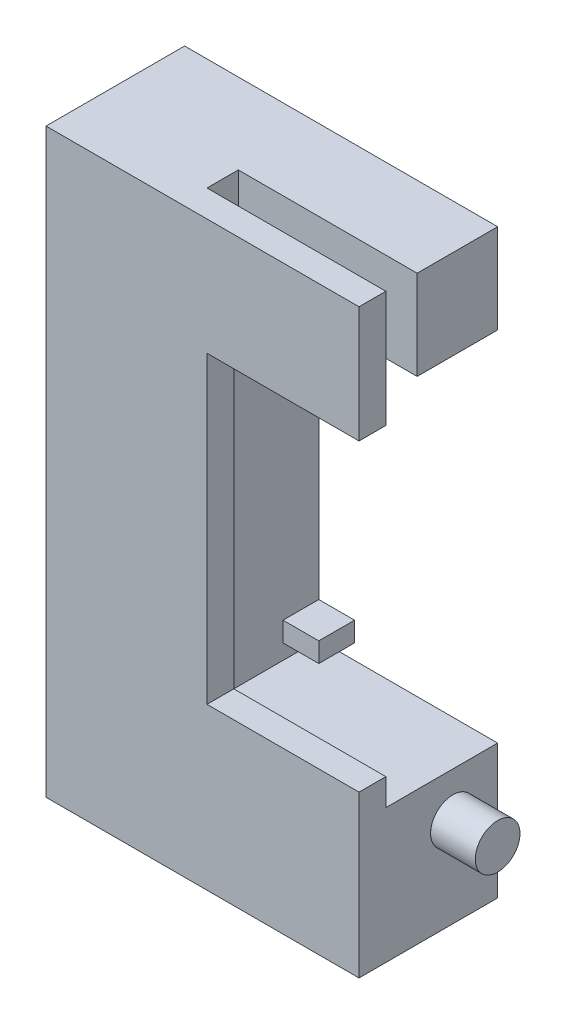
ISO-10303-21;
HEADER;
FILE_DESCRIPTION(('STEP AP214'),'2;1');
FILE_NAME('part.step','',(''),(''),'','','');
FILE_SCHEMA(('AUTOMOTIVE_DESIGN { 1 0 10303 214 1 1 1 1 }'));
ENDSEC;
DATA;
#1=APPLICATION_CONTEXT('core data for automotive mechanical design processes');
#2=APPLICATION_PROTOCOL_DEFINITION('international standard','automotive_design',2000,#1);
#3=PRODUCT_CONTEXT('',#1,'mechanical');
#4=PRODUCT('Part','Part','',(#3));
#5=PRODUCT_RELATED_PRODUCT_CATEGORY('part','',(#4));
#6=PRODUCT_DEFINITION_FORMATION('','',#4);
#7=PRODUCT_DEFINITION_CONTEXT('part definition',#1,'design');
#8=PRODUCT_DEFINITION('design','',#6,#7);
#9=PRODUCT_DEFINITION_SHAPE('','',#8);
#10=(LENGTH_UNIT() NAMED_UNIT(*) SI_UNIT(.MILLI.,.METRE.));
#11=(NAMED_UNIT(*) PLANE_ANGLE_UNIT() SI_UNIT($,.RADIAN.));
#12=(NAMED_UNIT(*) SI_UNIT($,.STERADIAN.) SOLID_ANGLE_UNIT());
#13=UNCERTAINTY_MEASURE_WITH_UNIT(LENGTH_MEASURE(1.E-05),#10,'distance_accuracy_value','');
#14=(GEOMETRIC_REPRESENTATION_CONTEXT(3) GLOBAL_UNCERTAINTY_ASSIGNED_CONTEXT((#13)) GLOBAL_UNIT_ASSIGNED_CONTEXT((#10,
#11,#12)) REPRESENTATION_CONTEXT('',''));
#15=CARTESIAN_POINT('',(0.,0.,0.));
#16=DIRECTION('',(0.,0.,1.));
#17=DIRECTION('',(1.,0.,0.));
#18=AXIS2_PLACEMENT_3D('',#15,#16,#17);
#19=CARTESIAN_POINT('',(15.,55.,-4.));
#20=DIRECTION('',(1.,0.,0.));
#21=DIRECTION('',(0.,1.,0.));
#22=AXIS2_PLACEMENT_3D('',#19,#20,#21);
#23=PLANE('',#22);
#24=DIRECTION('',(0.,-1.,0.));
#25=VECTOR('',#24,1.);
#26=CARTESIAN_POINT('',(15.,16.7,0.));
#27=LINE('',#26,#25);
#28=CARTESIAN_POINT('',(15.,18.9,0.));
#29=VERTEX_POINT('',#28);
#30=CARTESIAN_POINT('',(15.,16.7,0.));
#31=VERTEX_POINT('',#30);
#32=EDGE_CURVE('E57',#29,#31,#27,.T.);
#33=ORIENTED_EDGE('',*,*,#32,.F.);
#34=DIRECTION('',(0.,0.,1.));
#35=VECTOR('',#34,1.);
#36=CARTESIAN_POINT('',(15.,18.9,-4.));
#37=LINE('',#36,#35);
#38=CARTESIAN_POINT('',(15.,18.9,-4.));
#39=VERTEX_POINT('',#38);
#40=EDGE_CURVE('E697',#39,#29,#37,.T.);
#41=ORIENTED_EDGE('',*,*,#40,.F.);
#42=DIRECTION('',(0.,1.,0.));
#43=VECTOR('',#42,1.);
#44=CARTESIAN_POINT('',(15.,55.,-4.));
#45=LINE('',#44,#43);
#46=CARTESIAN_POINT('',(15.,51.1,-4.));
#47=VERTEX_POINT('',#46);
#48=EDGE_CURVE('E214',#39,#47,#45,.T.);
#49=ORIENTED_EDGE('',*,*,#48,.T.);
#50=DIRECTION('',(0.,0.,-1.));
#51=VECTOR('',#50,1.);
#52=CARTESIAN_POINT('',(15.,51.1,-4.));
#53=LINE('',#52,#51);
#54=CARTESIAN_POINT('',(15.,51.1,0.));
#55=VERTEX_POINT('',#54);
#56=EDGE_CURVE('E232',#55,#47,#53,.T.);
#57=ORIENTED_EDGE('',*,*,#56,.F.);
#58=DIRECTION('',(0.,-1.,0.));
#59=VECTOR('',#58,1.);
#60=CARTESIAN_POINT('',(15.,53.3,0.));
#61=LINE('',#60,#59);
#62=CARTESIAN_POINT('',(15.,53.3,0.));
#63=VERTEX_POINT('',#62);
#64=EDGE_CURVE('E221',#63,#55,#61,.T.);
#65=ORIENTED_EDGE('',*,*,#64,.F.);
#66=DIRECTION('',(0.,0.,1.));
#67=VECTOR('',#66,1.);
#68=CARTESIAN_POINT('',(15.,53.3,-4.));
#69=LINE('',#68,#67);
#70=CARTESIAN_POINT('',(15.,53.3,-4.));
#71=VERTEX_POINT('',#70);
#72=EDGE_CURVE('E216',#71,#63,#69,.T.);
#73=ORIENTED_EDGE('',*,*,#72,.F.);
#74=CARTESIAN_POINT('',(15.,55.,-4.));
#75=VERTEX_POINT('',#74);
#76=EDGE_CURVE('E374',#71,#75,#45,.T.);
#77=ORIENTED_EDGE('',*,*,#76,.T.);
#78=DIRECTION('',(0.,0.,1.));
#79=VECTOR('',#78,1.);
#80=CARTESIAN_POINT('',(15.,55.,-4.));
#81=LINE('',#80,#79);
#82=CARTESIAN_POINT('',(15.,55.,5.));
#83=VERTEX_POINT('',#82);
#84=EDGE_CURVE('E404',#75,#83,#81,.T.);
#85=ORIENTED_EDGE('',*,*,#84,.T.);
#86=DIRECTION('',(0.,1.,0.));
#87=VECTOR('',#86,1.);
#88=CARTESIAN_POINT('',(15.,55.,5.));
#89=LINE('',#88,#87);
#90=CARTESIAN_POINT('',(15.,65.,5.));
#91=VERTEX_POINT('',#90);
#92=EDGE_CURVE('E342',#83,#91,#89,.T.);
#93=ORIENTED_EDGE('',*,*,#92,.T.);
#94=DIRECTION('',(0.,0.,1.));
#95=VECTOR('',#94,1.);
#96=CARTESIAN_POINT('',(15.,65.,5.));
#97=LINE('',#96,#95);
#98=CARTESIAN_POINT('',(15.,65.,8.5));
#99=VERTEX_POINT('',#98);
#100=EDGE_CURVE('E337',#91,#99,#97,.T.);
#101=ORIENTED_EDGE('',*,*,#100,.T.);
#102=DIRECTION('',(0.,1.,0.));
#103=VECTOR('',#102,1.);
#104=CARTESIAN_POINT('',(15.,55.,8.5));
#105=LINE('',#104,#103);
#106=CARTESIAN_POINT('',(15.,15.,8.5));
#107=VERTEX_POINT('',#106);
#108=EDGE_CURVE('E358',#107,#99,#105,.T.);
#109=ORIENTED_EDGE('',*,*,#108,.F.);
#110=DIRECTION('',(0.,0.,1.));
#111=VECTOR('',#110,1.);
#112=CARTESIAN_POINT('',(15.,15.,-4.));
#113=LINE('',#112,#111);
#114=CARTESIAN_POINT('',(15.,15.,-4.));
#115=VERTEX_POINT('',#114);
#116=EDGE_CURVE('E408',#115,#107,#113,.T.);
#117=ORIENTED_EDGE('',*,*,#116,.F.);
#118=CARTESIAN_POINT('',(15.,16.7,-4.));
#119=VERTEX_POINT('',#118);
#120=EDGE_CURVE('E375',#115,#119,#45,.T.);
#121=ORIENTED_EDGE('',*,*,#120,.T.);
#122=DIRECTION('',(0.,0.,-1.));
#123=VECTOR('',#122,1.);
#124=CARTESIAN_POINT('',(15.,16.7,-4.));
#125=LINE('',#124,#123);
#126=EDGE_CURVE('E62',#31,#119,#125,.T.);
#127=ORIENTED_EDGE('',*,*,#126,.F.);
#128=EDGE_LOOP('',(#33,#41,#49,#57,#65,#73,#77,#85,#93,#101,#109,#117,#121,#127));
#129=FACE_BOUND('',#128,.T.);
#130=ADVANCED_FACE('F39',(#129),#23,.T.);
#131=CARTESIAN_POINT('',(35.,0.,-4.));
#132=DIRECTION('',(0.,-1.,0.));
#133=DIRECTION('',(1.,0.,0.));
#134=AXIS2_PLACEMENT_3D('',#131,#132,#133);
#135=PLANE('',#134);
#136=DIRECTION('',(0.,0.,1.));
#137=VECTOR('',#136,1.);
#138=CARTESIAN_POINT('',(35.,0.,-4.));
#139=LINE('',#138,#137);
#140=CARTESIAN_POINT('',(35.,0.,-4.));
#141=VERTEX_POINT('',#140);
#142=CARTESIAN_POINT('',(35.,0.,11.5));
#143=VERTEX_POINT('',#142);
#144=EDGE_CURVE('E43',#141,#143,#139,.T.);
#145=ORIENTED_EDGE('',*,*,#144,.T.);
#146=DIRECTION('',(1.,0.,0.));
#147=VECTOR('',#146,1.);
#148=CARTESIAN_POINT('',(35.,0.,11.5));
#149=LINE('',#148,#147);
#150=CARTESIAN_POINT('',(0.,0.,11.5));
#151=VERTEX_POINT('',#150);
#152=EDGE_CURVE('E296',#151,#143,#149,.T.);
#153=ORIENTED_EDGE('',*,*,#152,.F.);
#154=DIRECTION('',(0.,0.,1.));
#155=VECTOR('',#154,1.);
#156=CARTESIAN_POINT('',(0.,0.,-4.));
#157=LINE('',#156,#155);
#158=CARTESIAN_POINT('',(0.,0.,-4.));
#159=VERTEX_POINT('',#158);
#160=EDGE_CURVE('E11',#159,#151,#157,.T.);
#161=ORIENTED_EDGE('',*,*,#160,.F.);
#162=DIRECTION('',(1.,0.,0.));
#163=VECTOR('',#162,1.);
#164=CARTESIAN_POINT('',(35.,0.,-4.));
#165=LINE('',#164,#163);
#166=EDGE_CURVE('E362',#159,#141,#165,.T.);
#167=ORIENTED_EDGE('',*,*,#166,.T.);
#168=EDGE_LOOP('',(#145,#153,#161,#167));
#169=FACE_BOUND('',#168,.T.);
#170=ADVANCED_FACE('F41',(#169),#135,.T.);
#171=CARTESIAN_POINT('',(0.,0.,-4.));
#172=DIRECTION('',(-1.,0.,0.));
#173=DIRECTION('',(0.,0.,1.));
#174=AXIS2_PLACEMENT_3D('',#171,#172,#173);
#175=PLANE('',#174);
#176=ORIENTED_EDGE('',*,*,#160,.T.);
#177=DIRECTION('',(0.,-1.,0.));
#178=VECTOR('',#177,1.);
#179=CARTESIAN_POINT('',(0.,0.,11.5));
#180=LINE('',#179,#178);
#181=CARTESIAN_POINT('',(0.,65.,11.5));
#182=VERTEX_POINT('',#181);
#183=EDGE_CURVE('E292',#182,#151,#180,.T.);
#184=ORIENTED_EDGE('',*,*,#183,.F.);
#185=DIRECTION('',(0.,0.,1.));
#186=VECTOR('',#185,1.);
#187=CARTESIAN_POINT('',(0.,65.,-4.));
#188=LINE('',#187,#186);
#189=CARTESIAN_POINT('',(0.,65.,-4.));
#190=VERTEX_POINT('',#189);
#191=EDGE_CURVE('E49',#190,#182,#188,.T.);
#192=ORIENTED_EDGE('',*,*,#191,.F.);
#193=DIRECTION('',(0.,-1.,0.));
#194=VECTOR('',#193,1.);
#195=CARTESIAN_POINT('',(0.,0.,-4.));
#196=LINE('',#195,#194);
#197=EDGE_CURVE('E390',#190,#159,#196,.T.);
#198=ORIENTED_EDGE('',*,*,#197,.T.);
#199=EDGE_LOOP('',(#176,#184,#192,#198));
#200=FACE_BOUND('',#199,.T.);
#201=ADVANCED_FACE('F448',(#200),#175,.T.);
#202=CARTESIAN_POINT('',(0.,65.,-4.));
#203=DIRECTION('',(0.,1.,0.));
#204=DIRECTION('',(-1.,0.,0.));
#205=AXIS2_PLACEMENT_3D('',#202,#203,#204);
#206=PLANE('',#205);
#207=ORIENTED_EDGE('',*,*,#100,.F.);
#208=DIRECTION('',(-1.,0.,0.));
#209=VECTOR('',#208,1.);
#210=CARTESIAN_POINT('',(15.,65.,5.));
#211=LINE('',#210,#209);
#212=CARTESIAN_POINT('',(35.,65.,5.));
#213=VERTEX_POINT('',#212);
#214=EDGE_CURVE('E343',#213,#91,#211,.T.);
#215=ORIENTED_EDGE('',*,*,#214,.F.);
#216=DIRECTION('',(0.,0.,1.));
#217=VECTOR('',#216,1.);
#218=CARTESIAN_POINT('',(35.,65.,-4.));
#219=LINE('',#218,#217);
#220=CARTESIAN_POINT('',(35.,65.,-4.));
#221=VERTEX_POINT('',#220);
#222=EDGE_CURVE('E396',#221,#213,#219,.T.);
#223=ORIENTED_EDGE('',*,*,#222,.F.);
#224=DIRECTION('',(-1.,0.,0.));
#225=VECTOR('',#224,1.);
#226=CARTESIAN_POINT('',(0.,65.,-4.));
#227=LINE('',#226,#225);
#228=EDGE_CURVE('E386',#221,#190,#227,.T.);
#229=ORIENTED_EDGE('',*,*,#228,.T.);
#230=ORIENTED_EDGE('',*,*,#191,.T.);
#231=DIRECTION('',(-1.,0.,0.));
#232=VECTOR('',#231,1.);
#233=CARTESIAN_POINT('',(0.,65.,11.5));
#234=LINE('',#233,#232);
#235=CARTESIAN_POINT('',(35.,65.,11.5));
#236=VERTEX_POINT('',#235);
#237=EDGE_CURVE('E288',#236,#182,#234,.T.);
#238=ORIENTED_EDGE('',*,*,#237,.F.);
#239=DIRECTION('',(0.,0.,-1.));
#240=VECTOR('',#239,1.);
#241=CARTESIAN_POINT('',(35.,65.,11.5));
#242=LINE('',#241,#240);
#243=CARTESIAN_POINT('',(35.,65.,8.5));
#244=VERTEX_POINT('',#243);
#245=EDGE_CURVE('E300',#236,#244,#242,.T.);
#246=ORIENTED_EDGE('',*,*,#245,.T.);
#247=DIRECTION('',(-1.,0.,0.));
#248=VECTOR('',#247,1.);
#249=CARTESIAN_POINT('',(0.,65.,8.5));
#250=LINE('',#249,#248);
#251=EDGE_CURVE('E276',#244,#99,#250,.T.);
#252=ORIENTED_EDGE('',*,*,#251,.T.);
#253=EDGE_LOOP('',(#207,#215,#223,#229,#230,#238,#246,#252));
#254=FACE_BOUND('',#253,.T.);
#255=ADVANCED_FACE('F459',(#254),#206,.T.);
#256=CARTESIAN_POINT('',(35.,65.,-4.));
#257=DIRECTION('',(1.,0.,0.));
#258=DIRECTION('',(0.,1.,0.));
#259=AXIS2_PLACEMENT_3D('',#256,#257,#258);
#260=PLANE('',#259);
#261=DIRECTION('',(0.,1.,0.));
#262=VECTOR('',#261,1.);
#263=CARTESIAN_POINT('',(35.,65.,5.));
#264=LINE('',#263,#262);
#265=CARTESIAN_POINT('',(35.,55.,5.));
#266=VERTEX_POINT('',#265);
#267=EDGE_CURVE('E351',#266,#213,#264,.T.);
#268=ORIENTED_EDGE('',*,*,#267,.F.);
#269=DIRECTION('',(0.,0.,1.));
#270=VECTOR('',#269,1.);
#271=CARTESIAN_POINT('',(35.,55.,-4.));
#272=LINE('',#271,#270);
#273=CARTESIAN_POINT('',(35.,55.,-4.));
#274=VERTEX_POINT('',#273);
#275=EDGE_CURVE('E400',#274,#266,#272,.T.);
#276=ORIENTED_EDGE('',*,*,#275,.F.);
#277=DIRECTION('',(0.,1.,0.));
#278=VECTOR('',#277,1.);
#279=CARTESIAN_POINT('',(35.,65.,-4.));
#280=LINE('',#279,#278);
#281=EDGE_CURVE('E382',#274,#221,#280,.T.);
#282=ORIENTED_EDGE('',*,*,#281,.T.);
#283=ORIENTED_EDGE('',*,*,#222,.T.);
#284=EDGE_LOOP('',(#268,#276,#282,#283));
#285=FACE_BOUND('',#284,.T.);
#286=ADVANCED_FACE('F470',(#285),#260,.T.);
#287=CARTESIAN_POINT('',(35.,55.,-4.));
#288=DIRECTION('',(0.,-1.,0.));
#289=DIRECTION('',(1.,0.,0.));
#290=AXIS2_PLACEMENT_3D('',#287,#288,#289);
#291=PLANE('',#290);
#292=DIRECTION('',(-1.,0.,0.));
#293=VECTOR('',#292,1.);
#294=CARTESIAN_POINT('',(15.,55.,5.));
#295=LINE('',#294,#293);
#296=EDGE_CURVE('E338',#266,#83,#295,.T.);
#297=ORIENTED_EDGE('',*,*,#296,.T.);
#298=ORIENTED_EDGE('',*,*,#84,.F.);
#299=DIRECTION('',(1.,0.,0.));
#300=VECTOR('',#299,1.);
#301=CARTESIAN_POINT('',(35.,55.,-4.));
#302=LINE('',#301,#300);
#303=EDGE_CURVE('E378',#75,#274,#302,.T.);
#304=ORIENTED_EDGE('',*,*,#303,.T.);
#305=ORIENTED_EDGE('',*,*,#275,.T.);
#306=EDGE_LOOP('',(#297,#298,#304,#305));
#307=FACE_BOUND('',#306,.T.);
#308=ADVANCED_FACE('F466',(#307),#291,.T.);
#309=CARTESIAN_POINT('',(15.,15.,-4.));
#310=DIRECTION('',(0.,1.,0.));
#311=DIRECTION('',(0.,0.,1.));
#312=AXIS2_PLACEMENT_3D('',#309,#310,#311);
#313=PLANE('',#312);
#314=ORIENTED_EDGE('',*,*,#116,.T.);
#315=DIRECTION('',(-1.,0.,0.));
#316=VECTOR('',#315,1.);
#317=CARTESIAN_POINT('',(15.,15.,8.5));
#318=LINE('',#317,#316);
#319=CARTESIAN_POINT('',(35.,15.,8.5));
#320=VERTEX_POINT('',#319);
#321=EDGE_CURVE('E354',#320,#107,#318,.T.);
#322=ORIENTED_EDGE('',*,*,#321,.F.);
#323=DIRECTION('',(0.,0.,1.));
#324=VECTOR('',#323,1.);
#325=CARTESIAN_POINT('',(35.,15.,-4.));
#326=LINE('',#325,#324);
#327=CARTESIAN_POINT('',(35.,15.,-4.));
#328=VERTEX_POINT('',#327);
#329=EDGE_CURVE('E411',#328,#320,#326,.T.);
#330=ORIENTED_EDGE('',*,*,#329,.F.);
#331=DIRECTION('',(-1.,0.,0.));
#332=VECTOR('',#331,1.);
#333=CARTESIAN_POINT('',(15.,15.,-4.));
#334=LINE('',#333,#332);
#335=EDGE_CURVE('E370',#328,#115,#334,.T.);
#336=ORIENTED_EDGE('',*,*,#335,.T.);
#337=EDGE_LOOP('',(#314,#322,#330,#336));
#338=FACE_BOUND('',#337,.T.);
#339=ADVANCED_FACE('F454',(#338),#313,.T.);
#340=CARTESIAN_POINT('',(35.,15.,-4.));
#341=DIRECTION('',(1.,0.,0.));
#342=DIRECTION('',(0.,0.,-1.));
#343=AXIS2_PLACEMENT_3D('',#340,#341,#342);
#344=PLANE('',#343);
#345=CARTESIAN_POINT('',(35.,10.,1.));
#346=DIRECTION('',(1.,0.,0.));
#347=DIRECTION('',(0.,0.,-1.));
#348=AXIS2_PLACEMENT_3D('',#345,#346,#347);
#349=CIRCLE('',#348,2.5);
#350=CARTESIAN_POINT('',(35.,10.,-1.5));
#351=VERTEX_POINT('',#350);
#352=EDGE_CURVE('E262',#351,#351,#349,.T.);
#353=ORIENTED_EDGE('',*,*,#352,.F.);
#354=EDGE_LOOP('',(#353));
#355=FACE_BOUND('',#354,.T.);
#356=ORIENTED_EDGE('',*,*,#329,.T.);
#357=DIRECTION('',(0.,1.,0.));
#358=VECTOR('',#357,1.);
#359=CARTESIAN_POINT('',(35.,18.,8.5));
#360=LINE('',#359,#358);
#361=CARTESIAN_POINT('',(35.,18.,8.5));
#362=VERTEX_POINT('',#361);
#363=EDGE_CURVE('E267',#320,#362,#360,.T.);
#364=ORIENTED_EDGE('',*,*,#363,.T.);
#365=DIRECTION('',(0.,0.,-1.));
#366=VECTOR('',#365,1.);
#367=CARTESIAN_POINT('',(35.,18.,11.5));
#368=LINE('',#367,#366);
#369=CARTESIAN_POINT('',(35.,18.,11.5));
#370=VERTEX_POINT('',#369);
#371=EDGE_CURVE('E333',#370,#362,#368,.T.);
#372=ORIENTED_EDGE('',*,*,#371,.F.);
#373=DIRECTION('',(0.,1.,0.));
#374=VECTOR('',#373,1.);
#375=CARTESIAN_POINT('',(35.,18.,11.5));
#376=LINE('',#375,#374);
#377=EDGE_CURVE('E271',#143,#370,#376,.T.);
#378=ORIENTED_EDGE('',*,*,#377,.F.);
#379=ORIENTED_EDGE('',*,*,#144,.F.);
#380=DIRECTION('',(0.,1.,0.));
#381=VECTOR('',#380,1.);
#382=CARTESIAN_POINT('',(35.,15.,-4.));
#383=LINE('',#382,#381);
#384=EDGE_CURVE('E366',#141,#328,#383,.T.);
#385=ORIENTED_EDGE('',*,*,#384,.T.);
#386=EDGE_LOOP('',(#356,#364,#372,#378,#379,#385));
#387=FACE_BOUND('',#386,.T.);
#388=ADVANCED_FACE('F424',(#355,#387),#344,.T.);
#389=CARTESIAN_POINT('',(0.,0.,-4.));
#390=DIRECTION('',(0.,0.,-1.));
#391=DIRECTION('',(-1.,0.,0.));
#392=AXIS2_PLACEMENT_3D('',#389,#390,#391);
#393=PLANE('',#392);
#394=ORIENTED_EDGE('',*,*,#166,.F.);
#395=ORIENTED_EDGE('',*,*,#197,.F.);
#396=ORIENTED_EDGE('',*,*,#228,.F.);
#397=ORIENTED_EDGE('',*,*,#281,.F.);
#398=ORIENTED_EDGE('',*,*,#303,.F.);
#399=ORIENTED_EDGE('',*,*,#76,.F.);
#400=DIRECTION('',(-1.,0.,0.));
#401=VECTOR('',#400,1.);
#402=CARTESIAN_POINT('',(19.,53.3,-4.));
#403=LINE('',#402,#401);
#404=CARTESIAN_POINT('',(19.,53.3,-4.));
#405=VERTEX_POINT('',#404);
#406=EDGE_CURVE('E258',#405,#71,#403,.T.);
#407=ORIENTED_EDGE('',*,*,#406,.F.);
#408=DIRECTION('',(0.,1.,0.));
#409=VECTOR('',#408,1.);
#410=CARTESIAN_POINT('',(19.,53.3,-4.));
#411=LINE('',#410,#409);
#412=CARTESIAN_POINT('',(19.,51.1,-4.));
#413=VERTEX_POINT('',#412);
#414=EDGE_CURVE('E227',#413,#405,#411,.T.);
#415=ORIENTED_EDGE('',*,*,#414,.F.);
#416=DIRECTION('',(-1.,0.,0.));
#417=VECTOR('',#416,1.);
#418=CARTESIAN_POINT('',(19.,51.1,-4.));
#419=LINE('',#418,#417);
#420=EDGE_CURVE('E240',#413,#47,#419,.T.);
#421=ORIENTED_EDGE('',*,*,#420,.T.);
#422=ORIENTED_EDGE('',*,*,#48,.F.);
#423=DIRECTION('',(-1.,0.,0.));
#424=VECTOR('',#423,1.);
#425=CARTESIAN_POINT('',(19.,18.9,-4.));
#426=LINE('',#425,#424);
#427=CARTESIAN_POINT('',(19.,18.9,-4.));
#428=VERTEX_POINT('',#427);
#429=EDGE_CURVE('E193',#428,#39,#426,.T.);
#430=ORIENTED_EDGE('',*,*,#429,.F.);
#431=DIRECTION('',(0.,1.,0.));
#432=VECTOR('',#431,1.);
#433=CARTESIAN_POINT('',(19.,16.7,-4.));
#434=LINE('',#433,#432);
#435=CARTESIAN_POINT('',(19.,16.7,-4.));
#436=VERTEX_POINT('',#435);
#437=EDGE_CURVE('E200',#436,#428,#434,.T.);
#438=ORIENTED_EDGE('',*,*,#437,.F.);
#439=DIRECTION('',(-1.,0.,0.));
#440=VECTOR('',#439,1.);
#441=CARTESIAN_POINT('',(19.,16.7,-4.));
#442=LINE('',#441,#440);
#443=EDGE_CURVE('E685',#436,#119,#442,.T.);
#444=ORIENTED_EDGE('',*,*,#443,.T.);
#445=ORIENTED_EDGE('',*,*,#120,.F.);
#446=ORIENTED_EDGE('',*,*,#335,.F.);
#447=ORIENTED_EDGE('',*,*,#384,.F.);
#448=EDGE_LOOP('',(#394,#395,#396,#397,#398,#399,#407,#415,#421,#422,#430,#438,#444,#445,#446,#447));
#449=FACE_BOUND('',#448,.T.);
#450=ADVANCED_FACE('F212',(#449),#393,.T.);
#451=CARTESIAN_POINT('',(15.,55.,5.));
#452=DIRECTION('',(0.,0.,-1.));
#453=DIRECTION('',(-1.,0.,0.));
#454=AXIS2_PLACEMENT_3D('',#451,#452,#453);
#455=PLANE('',#454);
#456=ORIENTED_EDGE('',*,*,#267,.T.);
#457=ORIENTED_EDGE('',*,*,#214,.T.);
#458=ORIENTED_EDGE('',*,*,#92,.F.);
#459=ORIENTED_EDGE('',*,*,#296,.F.);
#460=EDGE_LOOP('',(#456,#457,#458,#459));
#461=FACE_BOUND('',#460,.T.);
#462=ADVANCED_FACE('F463',(#461),#455,.F.);
#463=CARTESIAN_POINT('',(18.,18.,11.5));
#464=DIRECTION('',(0.,-1.,0.));
#465=DIRECTION('',(0.,0.,-1.));
#466=AXIS2_PLACEMENT_3D('',#463,#464,#465);
#467=PLANE('',#466);
#468=DIRECTION('',(-1.,0.,0.));
#469=VECTOR('',#468,1.);
#470=CARTESIAN_POINT('',(18.,18.,8.5));
#471=LINE('',#470,#469);
#472=CARTESIAN_POINT('',(18.,18.,8.5));
#473=VERTEX_POINT('',#472);
#474=EDGE_CURVE('E303',#362,#473,#471,.T.);
#475=ORIENTED_EDGE('',*,*,#474,.T.);
#476=DIRECTION('',(0.,0.,-1.));
#477=VECTOR('',#476,1.);
#478=CARTESIAN_POINT('',(18.,18.,11.5));
#479=LINE('',#478,#477);
#480=CARTESIAN_POINT('',(18.,18.,11.5));
#481=VERTEX_POINT('',#480);
#482=EDGE_CURVE('E329',#481,#473,#479,.T.);
#483=ORIENTED_EDGE('',*,*,#482,.F.);
#484=DIRECTION('',(-1.,0.,0.));
#485=VECTOR('',#484,1.);
#486=CARTESIAN_POINT('',(18.,18.,11.5));
#487=LINE('',#486,#485);
#488=EDGE_CURVE('E275',#370,#481,#487,.T.);
#489=ORIENTED_EDGE('',*,*,#488,.F.);
#490=ORIENTED_EDGE('',*,*,#371,.T.);
#491=EDGE_LOOP('',(#475,#483,#489,#490));
#492=FACE_BOUND('',#491,.T.);
#493=ADVANCED_FACE('F428',(#492),#467,.F.);
#494=CARTESIAN_POINT('',(18.,52.,11.5));
#495=DIRECTION('',(-1.,0.,0.));
#496=DIRECTION('',(0.,-1.,0.));
#497=AXIS2_PLACEMENT_3D('',#494,#495,#496);
#498=PLANE('',#497);
#499=DIRECTION('',(0.,1.,0.));
#500=VECTOR('',#499,1.);
#501=CARTESIAN_POINT('',(18.,52.,8.5));
#502=LINE('',#501,#500);
#503=CARTESIAN_POINT('',(18.,52.,8.5));
#504=VERTEX_POINT('',#503);
#505=EDGE_CURVE('E306',#473,#504,#502,.T.);
#506=ORIENTED_EDGE('',*,*,#505,.T.);
#507=DIRECTION('',(0.,0.,-1.));
#508=VECTOR('',#507,1.);
#509=CARTESIAN_POINT('',(18.,52.,11.5));
#510=LINE('',#509,#508);
#511=CARTESIAN_POINT('',(18.,52.,11.5));
#512=VERTEX_POINT('',#511);
#513=EDGE_CURVE('E325',#512,#504,#510,.T.);
#514=ORIENTED_EDGE('',*,*,#513,.F.);
#515=DIRECTION('',(0.,1.,0.));
#516=VECTOR('',#515,1.);
#517=CARTESIAN_POINT('',(18.,52.,11.5));
#518=LINE('',#517,#516);
#519=EDGE_CURVE('E279',#481,#512,#518,.T.);
#520=ORIENTED_EDGE('',*,*,#519,.F.);
#521=ORIENTED_EDGE('',*,*,#482,.T.);
#522=EDGE_LOOP('',(#506,#514,#520,#521));
#523=FACE_BOUND('',#522,.T.);
#524=ADVANCED_FACE('F435',(#523),#498,.F.);
#525=CARTESIAN_POINT('',(35.,52.,11.5));
#526=DIRECTION('',(0.,1.,0.));
#527=DIRECTION('',(-1.,0.,0.));
#528=AXIS2_PLACEMENT_3D('',#525,#526,#527);
#529=PLANE('',#528);
#530=DIRECTION('',(1.,0.,0.));
#531=VECTOR('',#530,1.);
#532=CARTESIAN_POINT('',(35.,52.,8.5));
#533=LINE('',#532,#531);
#534=CARTESIAN_POINT('',(35.,52.,8.5));
#535=VERTEX_POINT('',#534);
#536=EDGE_CURVE('E309',#504,#535,#533,.T.);
#537=ORIENTED_EDGE('',*,*,#536,.T.);
#538=DIRECTION('',(0.,0.,-1.));
#539=VECTOR('',#538,1.);
#540=CARTESIAN_POINT('',(35.,52.,11.5));
#541=LINE('',#540,#539);
#542=CARTESIAN_POINT('',(35.,52.,11.5));
#543=VERTEX_POINT('',#542);
#544=EDGE_CURVE('E321',#543,#535,#541,.T.);
#545=ORIENTED_EDGE('',*,*,#544,.F.);
#546=DIRECTION('',(1.,0.,0.));
#547=VECTOR('',#546,1.);
#548=CARTESIAN_POINT('',(35.,52.,11.5));
#549=LINE('',#548,#547);
#550=EDGE_CURVE('E282',#512,#543,#549,.T.);
#551=ORIENTED_EDGE('',*,*,#550,.F.);
#552=ORIENTED_EDGE('',*,*,#513,.T.);
#553=EDGE_LOOP('',(#537,#545,#551,#552));
#554=FACE_BOUND('',#553,.T.);
#555=ADVANCED_FACE('F439',(#554),#529,.F.);
#556=CARTESIAN_POINT('',(35.,65.,11.5));
#557=DIRECTION('',(-1.,0.,0.));
#558=DIRECTION('',(0.,0.,1.));
#559=AXIS2_PLACEMENT_3D('',#556,#557,#558);
#560=PLANE('',#559);
#561=DIRECTION('',(0.,1.,0.));
#562=VECTOR('',#561,1.);
#563=CARTESIAN_POINT('',(35.,65.,8.5));
#564=LINE('',#563,#562);
#565=EDGE_CURVE('E312',#535,#244,#564,.T.);
#566=ORIENTED_EDGE('',*,*,#565,.T.);
#567=ORIENTED_EDGE('',*,*,#245,.F.);
#568=DIRECTION('',(0.,1.,0.));
#569=VECTOR('',#568,1.);
#570=CARTESIAN_POINT('',(35.,65.,11.5));
#571=LINE('',#570,#569);
#572=EDGE_CURVE('E285',#543,#236,#571,.T.);
#573=ORIENTED_EDGE('',*,*,#572,.F.);
#574=ORIENTED_EDGE('',*,*,#544,.T.);
#575=EDGE_LOOP('',(#566,#567,#573,#574));
#576=FACE_BOUND('',#575,.T.);
#577=ADVANCED_FACE('F444',(#576),#560,.F.);
#578=CARTESIAN_POINT('',(0.,0.,11.5));
#579=DIRECTION('',(0.,0.,-1.));
#580=DIRECTION('',(-1.,0.,0.));
#581=AXIS2_PLACEMENT_3D('',#578,#579,#580);
#582=PLANE('',#581);
#583=ORIENTED_EDGE('',*,*,#377,.T.);
#584=ORIENTED_EDGE('',*,*,#488,.T.);
#585=ORIENTED_EDGE('',*,*,#519,.T.);
#586=ORIENTED_EDGE('',*,*,#550,.T.);
#587=ORIENTED_EDGE('',*,*,#572,.T.);
#588=ORIENTED_EDGE('',*,*,#237,.T.);
#589=ORIENTED_EDGE('',*,*,#183,.T.);
#590=ORIENTED_EDGE('',*,*,#152,.T.);
#591=EDGE_LOOP('',(#583,#584,#585,#586,#587,#588,#589,#590));
#592=FACE_BOUND('',#591,.T.);
#593=ADVANCED_FACE('F421',(#592),#582,.F.);
#594=CARTESIAN_POINT('',(0.,0.,8.5));
#595=DIRECTION('',(0.,0.,-1.));
#596=DIRECTION('',(-1.,0.,0.));
#597=AXIS2_PLACEMENT_3D('',#594,#595,#596);
#598=PLANE('',#597);
#599=ORIENTED_EDGE('',*,*,#321,.T.);
#600=ORIENTED_EDGE('',*,*,#108,.T.);
#601=ORIENTED_EDGE('',*,*,#251,.F.);
#602=ORIENTED_EDGE('',*,*,#565,.F.);
#603=ORIENTED_EDGE('',*,*,#536,.F.);
#604=ORIENTED_EDGE('',*,*,#505,.F.);
#605=ORIENTED_EDGE('',*,*,#474,.F.);
#606=ORIENTED_EDGE('',*,*,#363,.F.);
#607=EDGE_LOOP('',(#599,#600,#601,#602,#603,#604,#605,#606));
#608=FACE_BOUND('',#607,.T.);
#609=ADVANCED_FACE('F456',(#608),#598,.T.);
#610=CARTESIAN_POINT('',(40.,10.,1.));
#611=DIRECTION('',(-1.,0.,0.));
#612=DIRECTION('',(0.,0.,1.));
#613=AXIS2_PLACEMENT_3D('',#610,#611,#612);
#614=CYLINDRICAL_SURFACE('',#613,2.5);
#615=CARTESIAN_POINT('',(40.,10.,1.));
#616=DIRECTION('',(1.,0.,0.));
#617=DIRECTION('',(0.,0.,-1.));
#618=AXIS2_PLACEMENT_3D('',#615,#616,#617);
#619=CIRCLE('',#618,2.5);
#620=CARTESIAN_POINT('',(40.,10.,-1.5));
#621=VERTEX_POINT('',#620);
#622=EDGE_CURVE('E263',#621,#621,#619,.T.);
#623=ORIENTED_EDGE('',*,*,#622,.F.);
#624=EDGE_LOOP('',(#623));
#625=FACE_BOUND('',#624,.T.);
#626=ORIENTED_EDGE('',*,*,#352,.T.);
#627=EDGE_LOOP('',(#626));
#628=FACE_BOUND('',#627,.T.);
#629=ADVANCED_FACE('F514',(#625,#628),#614,.T.);
#630=CARTESIAN_POINT('',(40.,10.,1.));
#631=DIRECTION('',(1.,0.,0.));
#632=DIRECTION('',(0.,0.,-1.));
#633=AXIS2_PLACEMENT_3D('',#630,#631,#632);
#634=PLANE('',#633);
#635=ORIENTED_EDGE('',*,*,#622,.T.);
#636=EDGE_LOOP('',(#635));
#637=FACE_BOUND('',#636,.T.);
#638=ADVANCED_FACE('F495',(#637),#634,.T.);
#639=CARTESIAN_POINT('',(19.,53.3,-4.));
#640=DIRECTION('',(0.,-1.,0.));
#641=DIRECTION('',(1.,0.,0.));
#642=AXIS2_PLACEMENT_3D('',#639,#640,#641);
#643=PLANE('',#642);
#644=ORIENTED_EDGE('',*,*,#72,.T.);
#645=DIRECTION('',(-1.,0.,0.));
#646=VECTOR('',#645,1.);
#647=CARTESIAN_POINT('',(19.,53.3,0.));
#648=LINE('',#647,#646);
#649=CARTESIAN_POINT('',(19.,53.3,0.));
#650=VERTEX_POINT('',#649);
#651=EDGE_CURVE('E254',#650,#63,#648,.T.);
#652=ORIENTED_EDGE('',*,*,#651,.F.);
#653=DIRECTION('',(0.,0.,1.));
#654=VECTOR('',#653,1.);
#655=CARTESIAN_POINT('',(19.,53.3,-4.));
#656=LINE('',#655,#654);
#657=EDGE_CURVE('E231',#405,#650,#656,.T.);
#658=ORIENTED_EDGE('',*,*,#657,.F.);
#659=ORIENTED_EDGE('',*,*,#406,.T.);
#660=EDGE_LOOP('',(#644,#652,#658,#659));
#661=FACE_BOUND('',#660,.T.);
#662=ADVANCED_FACE('F477',(#661),#643,.F.);
#663=CARTESIAN_POINT('',(19.,53.3,0.));
#664=DIRECTION('',(0.,0.,-1.));
#665=DIRECTION('',(-1.,0.,0.));
#666=AXIS2_PLACEMENT_3D('',#663,#664,#665);
#667=PLANE('',#666);
#668=ORIENTED_EDGE('',*,*,#64,.T.);
#669=DIRECTION('',(-1.,0.,0.));
#670=VECTOR('',#669,1.);
#671=CARTESIAN_POINT('',(19.,51.1,0.));
#672=LINE('',#671,#670);
#673=CARTESIAN_POINT('',(19.,51.1,0.));
#674=VERTEX_POINT('',#673);
#675=EDGE_CURVE('E250',#674,#55,#672,.T.);
#676=ORIENTED_EDGE('',*,*,#675,.F.);
#677=DIRECTION('',(0.,-1.,0.));
#678=VECTOR('',#677,1.);
#679=CARTESIAN_POINT('',(19.,53.3,0.));
#680=LINE('',#679,#678);
#681=EDGE_CURVE('E235',#650,#674,#680,.T.);
#682=ORIENTED_EDGE('',*,*,#681,.F.);
#683=ORIENTED_EDGE('',*,*,#651,.T.);
#684=EDGE_LOOP('',(#668,#676,#682,#683));
#685=FACE_BOUND('',#684,.T.);
#686=ADVANCED_FACE('F487',(#685),#667,.F.);
#687=CARTESIAN_POINT('',(19.,51.1,-4.));
#688=DIRECTION('',(0.,1.,0.));
#689=DIRECTION('',(-1.,0.,0.));
#690=AXIS2_PLACEMENT_3D('',#687,#688,#689);
#691=PLANE('',#690);
#692=ORIENTED_EDGE('',*,*,#56,.T.);
#693=ORIENTED_EDGE('',*,*,#420,.F.);
#694=DIRECTION('',(0.,0.,-1.));
#695=VECTOR('',#694,1.);
#696=CARTESIAN_POINT('',(19.,51.1,-4.));
#697=LINE('',#696,#695);
#698=EDGE_CURVE('E238',#674,#413,#697,.T.);
#699=ORIENTED_EDGE('',*,*,#698,.F.);
#700=ORIENTED_EDGE('',*,*,#675,.T.);
#701=EDGE_LOOP('',(#692,#693,#699,#700));
#702=FACE_BOUND('',#701,.T.);
#703=ADVANCED_FACE('F484',(#702),#691,.F.);
#704=CARTESIAN_POINT('',(19.,0.,0.));
#705=DIRECTION('',(-1.,0.,0.));
#706=DIRECTION('',(0.,0.,1.));
#707=AXIS2_PLACEMENT_3D('',#704,#705,#706);
#708=PLANE('',#707);
#709=ORIENTED_EDGE('',*,*,#414,.T.);
#710=ORIENTED_EDGE('',*,*,#657,.T.);
#711=ORIENTED_EDGE('',*,*,#681,.T.);
#712=ORIENTED_EDGE('',*,*,#698,.T.);
#713=EDGE_LOOP('',(#709,#710,#711,#712));
#714=FACE_BOUND('',#713,.T.);
#715=ADVANCED_FACE('F480',(#714),#708,.F.);
#716=CARTESIAN_POINT('',(19.,18.9,-4.));
#717=DIRECTION('',(0.,-1.,0.));
#718=DIRECTION('',(1.,0.,0.));
#719=AXIS2_PLACEMENT_3D('',#716,#717,#718);
#720=PLANE('',#719);
#721=ORIENTED_EDGE('',*,*,#40,.T.);
#722=DIRECTION('',(-1.,0.,0.));
#723=VECTOR('',#722,1.);
#724=CARTESIAN_POINT('',(19.,18.9,0.));
#725=LINE('',#724,#723);
#726=CARTESIAN_POINT('',(19.,18.9,0.));
#727=VERTEX_POINT('',#726);
#728=EDGE_CURVE('E195',#727,#29,#725,.T.);
#729=ORIENTED_EDGE('',*,*,#728,.F.);
#730=DIRECTION('',(0.,0.,1.));
#731=VECTOR('',#730,1.);
#732=CARTESIAN_POINT('',(19.,18.9,-4.));
#733=LINE('',#732,#731);
#734=EDGE_CURVE('E189',#428,#727,#733,.T.);
#735=ORIENTED_EDGE('',*,*,#734,.F.);
#736=ORIENTED_EDGE('',*,*,#429,.T.);
#737=EDGE_LOOP('',(#721,#729,#735,#736));
#738=FACE_BOUND('',#737,.T.);
#739=ADVANCED_FACE('F191',(#738),#720,.F.);
#740=CARTESIAN_POINT('',(19.,16.7,0.));
#741=DIRECTION('',(0.,0.,-1.));
#742=DIRECTION('',(-1.,0.,0.));
#743=AXIS2_PLACEMENT_3D('',#740,#741,#742);
#744=PLANE('',#743);
#745=ORIENTED_EDGE('',*,*,#32,.T.);
#746=DIRECTION('',(-1.,0.,0.));
#747=VECTOR('',#746,1.);
#748=CARTESIAN_POINT('',(19.,16.7,0.));
#749=LINE('',#748,#747);
#750=CARTESIAN_POINT('',(19.,16.7,0.));
#751=VERTEX_POINT('',#750);
#752=EDGE_CURVE('E223',#751,#31,#749,.T.);
#753=ORIENTED_EDGE('',*,*,#752,.F.);
#754=DIRECTION('',(0.,-1.,0.));
#755=VECTOR('',#754,1.);
#756=CARTESIAN_POINT('',(19.,16.7,0.));
#757=LINE('',#756,#755);
#758=EDGE_CURVE('E199',#727,#751,#757,.T.);
#759=ORIENTED_EDGE('',*,*,#758,.F.);
#760=ORIENTED_EDGE('',*,*,#728,.T.);
#761=EDGE_LOOP('',(#745,#753,#759,#760));
#762=FACE_BOUND('',#761,.T.);
#763=ADVANCED_FACE('F653',(#762),#744,.F.);
#764=CARTESIAN_POINT('',(19.,16.7,-4.));
#765=DIRECTION('',(0.,1.,0.));
#766=DIRECTION('',(-1.,0.,0.));
#767=AXIS2_PLACEMENT_3D('',#764,#765,#766);
#768=PLANE('',#767);
#769=ORIENTED_EDGE('',*,*,#126,.T.);
#770=ORIENTED_EDGE('',*,*,#443,.F.);
#771=DIRECTION('',(0.,0.,-1.));
#772=VECTOR('',#771,1.);
#773=CARTESIAN_POINT('',(19.,16.7,-4.));
#774=LINE('',#773,#772);
#775=EDGE_CURVE('E205',#751,#436,#774,.T.);
#776=ORIENTED_EDGE('',*,*,#775,.F.);
#777=ORIENTED_EDGE('',*,*,#752,.T.);
#778=EDGE_LOOP('',(#769,#770,#776,#777));
#779=FACE_BOUND('',#778,.T.);
#780=ADVANCED_FACE('F662',(#779),#768,.F.);
#781=CARTESIAN_POINT('',(19.,0.,0.));
#782=DIRECTION('',(1.,0.,0.));
#783=DIRECTION('',(0.,0.,-1.));
#784=AXIS2_PLACEMENT_3D('',#781,#782,#783);
#785=PLANE('',#784);
#786=ORIENTED_EDGE('',*,*,#437,.T.);
#787=ORIENTED_EDGE('',*,*,#734,.T.);
#788=ORIENTED_EDGE('',*,*,#758,.T.);
#789=ORIENTED_EDGE('',*,*,#775,.T.);
#790=EDGE_LOOP('',(#786,#787,#788,#789));
#791=FACE_BOUND('',#790,.T.);
#792=ADVANCED_FACE('F203',(#791),#785,.T.);
#793=CLOSED_SHELL('',(#130,#170,#201,#255,#286,#308,#339,#388,#450,#462,#493,#524,#555,#577,
#593,#609,#629,#638,#662,#686,#703,#715,#739,#763,#780,#792));
#794=MANIFOLD_SOLID_BREP('B2',#793);
#795=ADVANCED_BREP_SHAPE_REPRESENTATION('',(#18,#794),#14);
#796=SHAPE_DEFINITION_REPRESENTATION(#9,#795);
ENDSEC;
END-ISO-10303-21;
